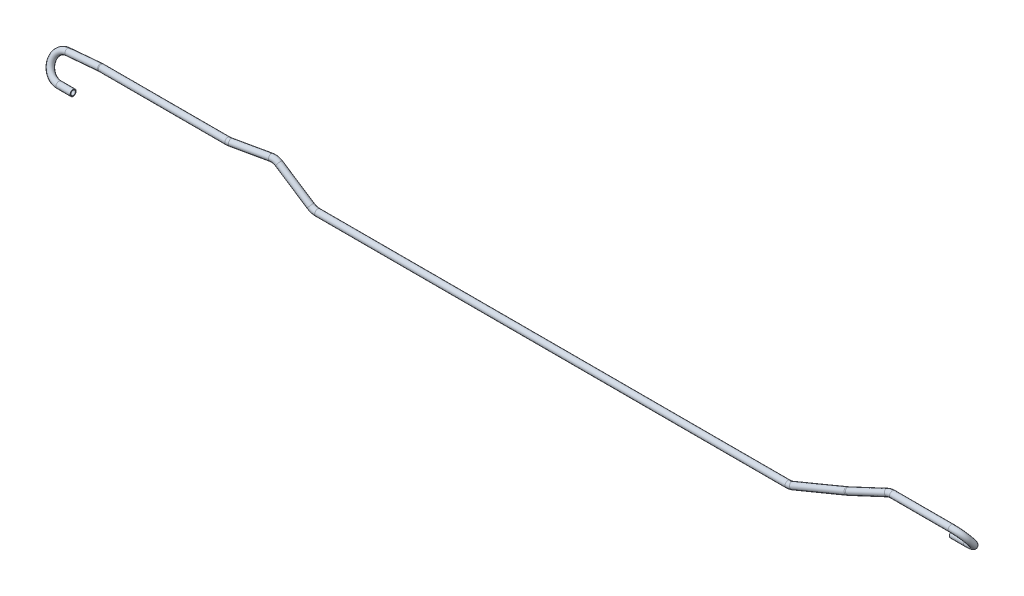
ISO-10303-21;
HEADER;
FILE_DESCRIPTION(('STEP AP214'),'2;1');
FILE_NAME('part.step','',(''),(''),'','','');
FILE_SCHEMA(('AUTOMOTIVE_DESIGN { 1 0 10303 214 1 1 1 1 }'));
ENDSEC;
DATA;
#1=APPLICATION_CONTEXT('core data for automotive mechanical design processes');
#2=APPLICATION_PROTOCOL_DEFINITION('international standard','automotive_design',2000,#1);
#3=PRODUCT_CONTEXT('',#1,'mechanical');
#4=PRODUCT('Part','Part','',(#3));
#5=PRODUCT_RELATED_PRODUCT_CATEGORY('part','',(#4));
#6=PRODUCT_DEFINITION_FORMATION('','',#4);
#7=PRODUCT_DEFINITION_CONTEXT('part definition',#1,'design');
#8=PRODUCT_DEFINITION('design','',#6,#7);
#9=PRODUCT_DEFINITION_SHAPE('','',#8);
#10=(LENGTH_UNIT() NAMED_UNIT(*) SI_UNIT(.MILLI.,.METRE.));
#11=(NAMED_UNIT(*) PLANE_ANGLE_UNIT() SI_UNIT($,.RADIAN.));
#12=(NAMED_UNIT(*) SI_UNIT($,.STERADIAN.) SOLID_ANGLE_UNIT());
#13=UNCERTAINTY_MEASURE_WITH_UNIT(LENGTH_MEASURE(1.E-05),#10,'distance_accuracy_value','');
#14=(GEOMETRIC_REPRESENTATION_CONTEXT(3) GLOBAL_UNCERTAINTY_ASSIGNED_CONTEXT((#13)) GLOBAL_UNIT_ASSIGNED_CONTEXT((#10,
#11,#12)) REPRESENTATION_CONTEXT('',''));
#15=CARTESIAN_POINT('',(0.,0.,0.));
#16=DIRECTION('',(0.,0.,1.));
#17=DIRECTION('',(1.,0.,0.));
#18=AXIS2_PLACEMENT_3D('',#15,#16,#17);
#19=CARTESIAN_POINT('',(-2235.,-51.0023810063754,98.9999999999986));
#20=DIRECTION('',(1.,0.,0.));
#21=DIRECTION('',(0.,0.,-1.));
#22=AXIS2_PLACEMENT_3D('',#19,#20,#21);
#23=CYLINDRICAL_SURFACE('',#22,8.);
#24=CARTESIAN_POINT('',(-2235.,-51.0023810063754,98.9999999999986));
#25=DIRECTION('',(1.,0.,0.));
#26=DIRECTION('',(0.,-0.823572064738296,0.567211648489961));
#27=AXIS2_PLACEMENT_3D('',#24,#25,#26);
#28=CIRCLE('',#27,8.);
#29=CARTESIAN_POINT('',(-2235.,-58.3869963909908,102.076923076922));
#30=VERTEX_POINT('',#29);
#31=EDGE_CURVE('E53',#30,#30,#28,.T.);
#32=ORIENTED_EDGE('',*,*,#31,.T.);
#33=EDGE_LOOP('',(#32));
#34=FACE_BOUND('',#33,.T.);
#35=CARTESIAN_POINT('',(-2198.,-51.0023810063754,98.9999999999986));
#36=DIRECTION('',(1.,0.,0.));
#37=DIRECTION('',(0.,-0.823572064738296,0.567211648489961));
#38=AXIS2_PLACEMENT_3D('',#35,#36,#37);
#39=CIRCLE('',#38,8.);
#40=CARTESIAN_POINT('',(-2198.,-57.5909575242817,103.537693187918));
#41=VERTEX_POINT('',#40);
#42=EDGE_CURVE('E10',#41,#41,#39,.T.);
#43=ORIENTED_EDGE('',*,*,#42,.F.);
#44=EDGE_LOOP('',(#43));
#45=FACE_BOUND('',#44,.T.);
#46=ADVANCED_FACE('F43',(#34,#45),#23,.T.);
#47=CARTESIAN_POINT('',(-2235.,-51.0023810063754,98.9999999999986));
#48=DIRECTION('',(1.,0.,0.));
#49=DIRECTION('',(0.,0.,-1.));
#50=AXIS2_PLACEMENT_3D('',#47,#48,#49);
#51=CYLINDRICAL_SURFACE('',#50,6.);
#52=CARTESIAN_POINT('',(-2235.,-51.0023810063754,98.9999999999986));
#53=DIRECTION('',(1.,0.,0.));
#54=DIRECTION('',(0.,-0.823572064738296,0.567211648489961));
#55=AXIS2_PLACEMENT_3D('',#52,#53,#54);
#56=CIRCLE('',#55,6.);
#57=CARTESIAN_POINT('',(-2235.,-56.5408425448369,101.307692307691));
#58=VERTEX_POINT('',#57);
#59=EDGE_CURVE('E57',#58,#58,#56,.T.);
#60=ORIENTED_EDGE('',*,*,#59,.F.);
#61=EDGE_LOOP('',(#60));
#62=FACE_BOUND('',#61,.T.);
#63=CARTESIAN_POINT('',(-2198.,-51.0023810063754,98.9999999999986));
#64=DIRECTION('',(1.,0.,0.));
#65=DIRECTION('',(0.,-0.823572064738296,0.567211648489961));
#66=AXIS2_PLACEMENT_3D('',#63,#64,#65);
#67=CIRCLE('',#66,6.);
#68=CARTESIAN_POINT('',(-2198.,-55.9438133948051,102.403269890938));
#69=VERTEX_POINT('',#68);
#70=EDGE_CURVE('E49',#69,#69,#67,.T.);
#71=ORIENTED_EDGE('',*,*,#70,.T.);
#72=EDGE_LOOP('',(#71));
#73=FACE_BOUND('',#72,.T.);
#74=ADVANCED_FACE('F293',(#62,#73),#51,.F.);
#75=CARTESIAN_POINT('',(-2235.,-20.5408425448359,86.3076923076905));
#76=DIRECTION('',(0.,0.384615384615384,0.923076923076923));
#77=DIRECTION('',(0.,-0.923076923076923,0.384615384615384));
#78=AXIS2_PLACEMENT_3D('',#75,#76,#77);
#79=TOROIDAL_SURFACE('',#78,33.0000000000011,8.);
#80=CARTESIAN_POINT('',(-2237.17958290928,9.85418159648477,73.6430989154736));
#81=DIRECTION('',(-0.997816449083727,-0.0609673541056993,0.0254030642106947));
#82=DIRECTION('',(-0.0646199236301112,0.980693517931945,-0.184565677622639));
#83=AXIS2_PLACEMENT_3D('',#80,#81,#82);
#84=CIRCLE('',#83,8.);
#85=CARTESIAN_POINT('',(-2237.70796664486,17.2226722974107,70.5728944567545));
#86=VERTEX_POINT('',#85);
#87=EDGE_CURVE('E62',#86,#86,#84,.T.);
#88=CARTESIAN_POINT('',(-2235.,-20.5408425448359,86.3076923076905));
#89=DIRECTION('',(0.,0.384615384615384,0.923076923076923));
#90=DIRECTION('',(0.,-0.923076923076923,0.384615384615384));
#91=AXIS2_PLACEMENT_3D('',#88,#89,#90);
#92=CIRCLE('',#91,41.0000000000011);
#93=EDGE_CURVE('',#86,#30,#92,.T.);
#94=ORIENTED_EDGE('',*,*,#87,.T.);
#95=ORIENTED_EDGE('',*,*,#31,.F.);
#96=ORIENTED_EDGE('',*,*,#93,.T.);
#97=ORIENTED_EDGE('',*,*,#93,.F.);
#98=EDGE_LOOP('',(#94,#96,#95,#97));
#99=FACE_BOUND('',#98,.T.);
#100=ADVANCED_FACE('F289',(#99),#79,.T.);
#101=CARTESIAN_POINT('',(-2235.,-20.5408425448359,86.3076923076905));
#102=DIRECTION('',(0.,0.384615384615384,0.923076923076923));
#103=DIRECTION('',(0.,-0.923076923076923,0.384615384615384));
#104=AXIS2_PLACEMENT_3D('',#101,#102,#103);
#105=TOROIDAL_SURFACE('',#104,33.0000000000011,6.);
#106=CARTESIAN_POINT('',(-2237.17958290928,9.85418159648477,73.6430989154736));
#107=DIRECTION('',(-0.997816449083727,-0.0609673541056993,0.0254030642106947));
#108=DIRECTION('',(-0.0646199236301112,0.980693517931945,-0.184565677622639));
#109=AXIS2_PLACEMENT_3D('',#106,#107,#108);
#110=CIRCLE('',#109,6.);
#111=CARTESIAN_POINT('',(-2237.57587071097,15.3805496221792,71.3404455714342));
#112=VERTEX_POINT('',#111);
#113=EDGE_CURVE('E65',#112,#112,#110,.T.);
#114=CARTESIAN_POINT('',(-2235.,-20.5408425448359,86.3076923076905));
#115=DIRECTION('',(0.,0.384615384615384,0.923076923076923));
#116=DIRECTION('',(0.,-0.923076923076923,0.384615384615384));
#117=AXIS2_PLACEMENT_3D('',#114,#115,#116);
#118=CIRCLE('',#117,39.0000000000011);
#119=EDGE_CURVE('',#112,#58,#118,.T.);
#120=ORIENTED_EDGE('',*,*,#113,.F.);
#121=ORIENTED_EDGE('',*,*,#59,.T.);
#122=ORIENTED_EDGE('',*,*,#119,.T.);
#123=ORIENTED_EDGE('',*,*,#119,.F.);
#124=EDGE_LOOP('',(#120,#122,#121,#123));
#125=FACE_BOUND('',#124,.T.);
#126=ADVANCED_FACE('F286',(#125),#105,.F.);
#127=CARTESIAN_POINT('',(-2154.08860034665,14.9311046734079,71.5277143000889));
#128=DIRECTION('',(-0.997816449083726,-0.060967354105705,0.0254030642107109));
#129=DIRECTION('',(0.0609870352261399,-0.998138558284533,0.));
#130=AXIS2_PLACEMENT_3D('',#127,#128,#129);
#131=CYLINDRICAL_SURFACE('',#130,8.);
#132=CARTESIAN_POINT('',(-2154.08860034665,14.9311046734079,71.5277143000889));
#133=DIRECTION('',(-0.997816449083727,-0.0609673541056993,0.0254030642106947));
#134=DIRECTION('',(-0.0646199236301112,0.980693517931945,-0.184565677622639));
#135=AXIS2_PLACEMENT_3D('',#132,#133,#134);
#136=CIRCLE('',#135,8.);
#137=CARTESIAN_POINT('',(-2154.61698408223,22.2995953743339,68.4575098413698));
#138=VERTEX_POINT('',#137);
#139=EDGE_CURVE('E68',#138,#138,#136,.T.);
#140=ORIENTED_EDGE('',*,*,#139,.T.);
#141=EDGE_LOOP('',(#140));
#142=FACE_BOUND('',#141,.T.);
#143=ORIENTED_EDGE('',*,*,#87,.F.);
#144=EDGE_LOOP('',(#143));
#145=FACE_BOUND('',#144,.T.);
#146=ADVANCED_FACE('F282',(#142,#145),#131,.T.);
#147=CARTESIAN_POINT('',(-2154.08860034665,14.9311046734079,71.5277143000889));
#148=DIRECTION('',(-0.997816449083726,-0.060967354105705,0.0254030642107109));
#149=DIRECTION('',(0.0609870352261399,-0.998138558284533,0.));
#150=AXIS2_PLACEMENT_3D('',#147,#148,#149);
#151=CYLINDRICAL_SURFACE('',#150,6.);
#152=CARTESIAN_POINT('',(-2154.08860034665,14.9311046734079,71.5277143000889));
#153=DIRECTION('',(-0.997816449083727,-0.0609673541056993,0.0254030642106947));
#154=DIRECTION('',(-0.0646199236301112,0.980693517931945,-0.184565677622639));
#155=AXIS2_PLACEMENT_3D('',#152,#153,#154);
#156=CIRCLE('',#155,6.);
#157=CARTESIAN_POINT('',(-2154.48488814834,20.4574726991024,69.2250609560495));
#158=VERTEX_POINT('',#157);
#159=EDGE_CURVE('E71',#158,#158,#156,.T.);
#160=ORIENTED_EDGE('',*,*,#159,.F.);
#161=EDGE_LOOP('',(#160));
#162=FACE_BOUND('',#161,.T.);
#163=ORIENTED_EDGE('',*,*,#113,.T.);
#164=EDGE_LOOP('',(#163));
#165=FACE_BOUND('',#164,.T.);
#166=ADVANCED_FACE('F279',(#162,#165),#151,.F.);
#167=CARTESIAN_POINT('',(-2151.90901743737,-15.4639194679128,84.1923076923059));
#168=DIRECTION('',(0.,0.384615384615385,0.923076923076923));
#169=DIRECTION('',(0.,-0.923076923076923,0.384615384615385));
#170=AXIS2_PLACEMENT_3D('',#167,#168,#169);
#171=TOROIDAL_SURFACE('',#170,33.0000000000011,8.);
#172=CARTESIAN_POINT('',(-2151.90901743737,14.9976189936267,71.4999999999978));
#173=DIRECTION('',(-1.,0.,0.));
#174=DIRECTION('',(0.,0.982665523802678,-0.185387346735444));
#175=AXIS2_PLACEMENT_3D('',#172,#173,#174);
#176=CIRCLE('',#175,8.);
#177=CARTESIAN_POINT('',(-2151.90901743737,22.3822343782421,68.4230769230747));
#178=VERTEX_POINT('',#177);
#179=EDGE_CURVE('E74',#178,#178,#176,.T.);
#180=CARTESIAN_POINT('',(-2151.90901743737,-15.4639194679128,84.1923076923059));
#181=DIRECTION('',(0.,0.384615384615385,0.923076923076923));
#182=DIRECTION('',(0.,-0.923076923076923,0.384615384615385));
#183=AXIS2_PLACEMENT_3D('',#180,#181,#182);
#184=CIRCLE('',#183,41.0000000000011);
#185=EDGE_CURVE('',#178,#138,#184,.T.);
#186=ORIENTED_EDGE('',*,*,#179,.T.);
#187=ORIENTED_EDGE('',*,*,#139,.F.);
#188=ORIENTED_EDGE('',*,*,#185,.T.);
#189=ORIENTED_EDGE('',*,*,#185,.F.);
#190=EDGE_LOOP('',(#186,#188,#187,#189));
#191=FACE_BOUND('',#190,.T.);
#192=ADVANCED_FACE('F275',(#191),#171,.T.);
#193=CARTESIAN_POINT('',(-2151.90901743737,-15.4639194679128,84.1923076923059));
#194=DIRECTION('',(0.,0.384615384615385,0.923076923076923));
#195=DIRECTION('',(0.,-0.923076923076923,0.384615384615385));
#196=AXIS2_PLACEMENT_3D('',#193,#194,#195);
#197=TOROIDAL_SURFACE('',#196,33.0000000000011,6.);
#198=CARTESIAN_POINT('',(-2151.90901743737,14.9976189936267,71.4999999999978));
#199=DIRECTION('',(-1.,0.,0.));
#200=DIRECTION('',(0.,0.982665523802678,-0.185387346735444));
#201=AXIS2_PLACEMENT_3D('',#198,#199,#200);
#202=CIRCLE('',#201,6.);
#203=CARTESIAN_POINT('',(-2151.90901743737,20.5360805320882,69.1923076923054));
#204=VERTEX_POINT('',#203);
#205=EDGE_CURVE('E77',#204,#204,#202,.T.);
#206=CARTESIAN_POINT('',(-2151.90901743737,-15.4639194679128,84.1923076923059));
#207=DIRECTION('',(0.,0.384615384615385,0.923076923076923));
#208=DIRECTION('',(0.,-0.923076923076923,0.384615384615385));
#209=AXIS2_PLACEMENT_3D('',#206,#207,#208);
#210=CIRCLE('',#209,39.0000000000011);
#211=EDGE_CURVE('',#204,#158,#210,.T.);
#212=ORIENTED_EDGE('',*,*,#205,.F.);
#213=ORIENTED_EDGE('',*,*,#159,.T.);
#214=ORIENTED_EDGE('',*,*,#211,.T.);
#215=ORIENTED_EDGE('',*,*,#211,.F.);
#216=EDGE_LOOP('',(#212,#214,#213,#215));
#217=FACE_BOUND('',#216,.T.);
#218=ADVANCED_FACE('F272',(#217),#197,.F.);
#219=CARTESIAN_POINT('',(-1821.5074252003,14.9976189936267,71.4999999999978));
#220=DIRECTION('',(-1.,0.,0.));
#221=DIRECTION('',(0.,0.,1.));
#222=AXIS2_PLACEMENT_3D('',#219,#220,#221);
#223=CYLINDRICAL_SURFACE('',#222,8.);
#224=CARTESIAN_POINT('',(-1821.5074252003,14.9976189936267,71.4999999999978));
#225=DIRECTION('',(-1.,0.,0.));
#226=DIRECTION('',(0.,0.982665523802678,-0.185387346735444));
#227=AXIS2_PLACEMENT_3D('',#224,#225,#226);
#228=CIRCLE('',#227,8.);
#229=CARTESIAN_POINT('',(-1821.5074252003,14.9976189936267,79.4999999999978));
#230=VERTEX_POINT('',#229);
#231=EDGE_CURVE('E80',#230,#230,#228,.T.);
#232=ORIENTED_EDGE('',*,*,#231,.T.);
#233=EDGE_LOOP('',(#232));
#234=FACE_BOUND('',#233,.T.);
#235=ORIENTED_EDGE('',*,*,#179,.F.);
#236=EDGE_LOOP('',(#235));
#237=FACE_BOUND('',#236,.T.);
#238=ADVANCED_FACE('F268',(#234,#237),#223,.T.);
#239=CARTESIAN_POINT('',(-1821.5074252003,14.9976189936267,71.4999999999978));
#240=DIRECTION('',(-1.,0.,0.));
#241=DIRECTION('',(0.,0.,1.));
#242=AXIS2_PLACEMENT_3D('',#239,#240,#241);
#243=CYLINDRICAL_SURFACE('',#242,6.);
#244=CARTESIAN_POINT('',(-1821.5074252003,14.9976189936267,71.4999999999978));
#245=DIRECTION('',(-1.,0.,0.));
#246=DIRECTION('',(0.,0.982665523802678,-0.185387346735444));
#247=AXIS2_PLACEMENT_3D('',#244,#245,#246);
#248=CIRCLE('',#247,6.);
#249=CARTESIAN_POINT('',(-1821.5074252003,14.9976189936267,77.4999999999978));
#250=VERTEX_POINT('',#249);
#251=EDGE_CURVE('E83',#250,#250,#248,.T.);
#252=ORIENTED_EDGE('',*,*,#251,.F.);
#253=EDGE_LOOP('',(#252));
#254=FACE_BOUND('',#253,.T.);
#255=ORIENTED_EDGE('',*,*,#205,.T.);
#256=EDGE_LOOP('',(#255));
#257=FACE_BOUND('',#256,.T.);
#258=ADVANCED_FACE('F265',(#254,#257),#243,.F.);
#259=CARTESIAN_POINT('',(-1821.5074252003,14.9976189936267,38.5000000000004));
#260=DIRECTION('',(0.,-1.,0.));
#261=DIRECTION('',(0.,0.,-1.));
#262=AXIS2_PLACEMENT_3D('',#259,#260,#261);
#263=TOROIDAL_SURFACE('',#262,32.9999999999974,8.);
#264=CARTESIAN_POINT('',(-1814.57093378604,14.9976189936267,70.7627507639966));
#265=DIRECTION('',(-0.977659114060571,0.,0.210196709523008));
#266=DIRECTION('',(-0.0389678102709847,0.982665523802678,-0.181245629167416));
#267=AXIS2_PLACEMENT_3D('',#264,#265,#266);
#268=CIRCLE('',#267,8.);
#269=CARTESIAN_POINT('',(-1812.88936010986,14.9976189936267,78.5840236764811));
#270=VERTEX_POINT('',#269);
#271=EDGE_CURVE('E86',#270,#270,#268,.T.);
#272=CARTESIAN_POINT('',(-1821.5074252003,14.9976189936267,38.5000000000004));
#273=DIRECTION('',(0.,-1.,0.));
#274=DIRECTION('',(0.,0.,-1.));
#275=AXIS2_PLACEMENT_3D('',#272,#273,#274);
#276=CIRCLE('',#275,40.9999999999974);
#277=EDGE_CURVE('',#270,#230,#276,.T.);
#278=ORIENTED_EDGE('',*,*,#271,.T.);
#279=ORIENTED_EDGE('',*,*,#231,.F.);
#280=ORIENTED_EDGE('',*,*,#277,.T.);
#281=ORIENTED_EDGE('',*,*,#277,.F.);
#282=EDGE_LOOP('',(#278,#280,#279,#281));
#283=FACE_BOUND('',#282,.T.);
#284=ADVANCED_FACE('F261',(#283),#263,.T.);
#285=CARTESIAN_POINT('',(-1821.5074252003,14.9976189936267,38.5000000000004));
#286=DIRECTION('',(0.,-1.,0.));
#287=DIRECTION('',(0.,0.,-1.));
#288=AXIS2_PLACEMENT_3D('',#285,#286,#287);
#289=TOROIDAL_SURFACE('',#288,32.9999999999974,6.);
#290=CARTESIAN_POINT('',(-1814.57093378604,14.9976189936267,70.7627507639966));
#291=DIRECTION('',(-0.977659114060571,0.,0.210196709523008));
#292=DIRECTION('',(-0.0389678102709847,0.982665523802678,-0.181245629167416));
#293=AXIS2_PLACEMENT_3D('',#290,#291,#292);
#294=CIRCLE('',#293,6.);
#295=CARTESIAN_POINT('',(-1813.3097535289,14.9976189936267,76.6287054483599));
#296=VERTEX_POINT('',#295);
#297=EDGE_CURVE('E89',#296,#296,#294,.T.);
#298=CARTESIAN_POINT('',(-1821.5074252003,14.9976189936267,38.5000000000004));
#299=DIRECTION('',(0.,-1.,0.));
#300=DIRECTION('',(0.,0.,-1.));
#301=AXIS2_PLACEMENT_3D('',#298,#299,#300);
#302=CIRCLE('',#301,38.9999999999974);
#303=EDGE_CURVE('',#296,#250,#302,.T.);
#304=ORIENTED_EDGE('',*,*,#297,.F.);
#305=ORIENTED_EDGE('',*,*,#251,.T.);
#306=ORIENTED_EDGE('',*,*,#303,.T.);
#307=ORIENTED_EDGE('',*,*,#303,.F.);
#308=EDGE_LOOP('',(#304,#306,#305,#307));
#309=FACE_BOUND('',#308,.T.);
#310=ADVANCED_FACE('F258',(#309),#289,.F.);
#311=CARTESIAN_POINT('',(-1728.27069487577,14.9976189936267,52.2081993982879));
#312=DIRECTION('',(-0.977659114060568,0.,0.210196709523022));
#313=DIRECTION('',(0.210196709523022,0.,0.977659114060568));
#314=AXIS2_PLACEMENT_3D('',#311,#312,#313);
#315=CYLINDRICAL_SURFACE('',#314,8.);
#316=CARTESIAN_POINT('',(-1728.27069487577,14.9976189936267,52.2081993982879));
#317=DIRECTION('',(-0.977659114060571,0.,0.210196709523008));
#318=DIRECTION('',(-0.0389678102709847,0.982665523802678,-0.181245629167416));
#319=AXIS2_PLACEMENT_3D('',#316,#317,#318);
#320=CIRCLE('',#319,8.);
#321=CARTESIAN_POINT('',(-1728.78098779352,22.6203685273136,49.8347439669026));
#322=VERTEX_POINT('',#321);
#323=EDGE_CURVE('E92',#322,#322,#320,.T.);
#324=ORIENTED_EDGE('',*,*,#323,.T.);
#325=EDGE_LOOP('',(#324));
#326=FACE_BOUND('',#325,.T.);
#327=ORIENTED_EDGE('',*,*,#271,.F.);
#328=EDGE_LOOP('',(#327));
#329=FACE_BOUND('',#328,.T.);
#330=ADVANCED_FACE('F254',(#326,#329),#315,.T.);
#331=CARTESIAN_POINT('',(-1728.27069487577,14.9976189936267,52.2081993982879));
#332=DIRECTION('',(-0.977659114060568,0.,0.210196709523022));
#333=DIRECTION('',(0.210196709523022,0.,0.977659114060568));
#334=AXIS2_PLACEMENT_3D('',#331,#332,#333);
#335=CYLINDRICAL_SURFACE('',#334,6.);
#336=CARTESIAN_POINT('',(-1728.27069487577,14.9976189936267,52.2081993982879));
#337=DIRECTION('',(-0.977659114060571,0.,0.210196709523008));
#338=DIRECTION('',(-0.0389678102709847,0.982665523802678,-0.181245629167416));
#339=AXIS2_PLACEMENT_3D('',#336,#337,#338);
#340=CIRCLE('',#339,6.);
#341=CARTESIAN_POINT('',(-1728.65341456408,20.7146811438919,50.4281078247489));
#342=VERTEX_POINT('',#341);
#343=EDGE_CURVE('E95',#342,#342,#340,.T.);
#344=ORIENTED_EDGE('',*,*,#343,.F.);
#345=EDGE_LOOP('',(#344));
#346=FACE_BOUND('',#345,.T.);
#347=ORIENTED_EDGE('',*,*,#297,.T.);
#348=EDGE_LOOP('',(#347));
#349=FACE_BOUND('',#348,.T.);
#350=ADVANCED_FACE('F251',(#346,#349),#335,.F.);
#351=CARTESIAN_POINT('',(-1726.16573659006,-16.4462228328327,61.9987030527522));
#352=DIRECTION('',(0.20028460868739,0.30346152831423,0.931556319476247));
#353=DIRECTION('',(0.,-0.950822106578474,0.309737504415713));
#354=AXIS2_PLACEMENT_3D('',#351,#352,#353);
#355=TOROIDAL_SURFACE('',#354,33.0000000000009,8.);
#356=CARTESIAN_POINT('',(-1709.2320987633,9.21080417740537,49.9999999999976));
#357=DIRECTION('',(-0.834609406561721,0.550842208330745,0.));
#358=DIRECTION('',(0.533681183443436,0.808607853702155,-0.247664558162056));
#359=AXIS2_PLACEMENT_3D('',#356,#357,#358);
#360=CIRCLE('',#359,8.);
#361=CARTESIAN_POINT('',(-1705.12697444166,15.4306895132206,47.0912235023602));
#362=VERTEX_POINT('',#361);
#363=EDGE_CURVE('E98',#362,#362,#360,.T.);
#364=CARTESIAN_POINT('',(-1726.16573659006,-16.4462228328327,61.9987030527522));
#365=DIRECTION('',(0.20028460868739,0.30346152831423,0.931556319476247));
#366=DIRECTION('',(0.,-0.950822106578474,0.309737504415713));
#367=AXIS2_PLACEMENT_3D('',#364,#365,#366);
#368=CIRCLE('',#367,41.0000000000009);
#369=EDGE_CURVE('',#362,#322,#368,.T.);
#370=ORIENTED_EDGE('',*,*,#363,.T.);
#371=ORIENTED_EDGE('',*,*,#323,.F.);
#372=ORIENTED_EDGE('',*,*,#369,.T.);
#373=ORIENTED_EDGE('',*,*,#369,.F.);
#374=EDGE_LOOP('',(#370,#372,#371,#373));
#375=FACE_BOUND('',#374,.T.);
#376=ADVANCED_FACE('F247',(#375),#355,.T.);
#377=CARTESIAN_POINT('',(-1726.16573659006,-16.4462228328327,61.9987030527522));
#378=DIRECTION('',(0.20028460868739,0.30346152831423,0.931556319476247));
#379=DIRECTION('',(0.,-0.950822106578474,0.309737504415713));
#380=AXIS2_PLACEMENT_3D('',#377,#378,#379);
#381=TOROIDAL_SURFACE('',#380,33.0000000000009,6.);
#382=CARTESIAN_POINT('',(-1709.2320987633,9.21080417740537,49.9999999999976));
#383=DIRECTION('',(-0.834609406561721,0.550842208330745,0.));
#384=DIRECTION('',(0.533681183443436,0.808607853702155,-0.247664558162056));
#385=AXIS2_PLACEMENT_3D('',#382,#383,#384);
#386=CIRCLE('',#385,6.);
#387=CARTESIAN_POINT('',(-1706.15325552207,13.8757181792668,47.8184176267696));
#388=VERTEX_POINT('',#387);
#389=EDGE_CURVE('E101',#388,#388,#386,.T.);
#390=CARTESIAN_POINT('',(-1726.16573659006,-16.4462228328327,61.9987030527522));
#391=DIRECTION('',(0.20028460868739,0.30346152831423,0.931556319476247));
#392=DIRECTION('',(0.,-0.950822106578474,0.309737504415713));
#393=AXIS2_PLACEMENT_3D('',#390,#391,#392);
#394=CIRCLE('',#393,39.0000000000009);
#395=EDGE_CURVE('',#388,#342,#394,.T.);
#396=ORIENTED_EDGE('',*,*,#389,.F.);
#397=ORIENTED_EDGE('',*,*,#343,.T.);
#398=ORIENTED_EDGE('',*,*,#395,.T.);
#399=ORIENTED_EDGE('',*,*,#395,.F.);
#400=EDGE_LOOP('',(#396,#398,#397,#399));
#401=FACE_BOUND('',#400,.T.);
#402=ADVANCED_FACE('F244',(#401),#381,.F.);
#403=CARTESIAN_POINT('',(-1626.26952967191,-45.5444914229104,49.9999999999975));
#404=DIRECTION('',(-0.834609406561725,0.550842208330739,0.));
#405=DIRECTION('',(-0.55084220833074,-0.834609406561725,0.));
#406=AXIS2_PLACEMENT_3D('',#403,#404,#405);
#407=CYLINDRICAL_SURFACE('',#406,8.);
#408=CARTESIAN_POINT('',(-1626.26952967191,-45.5444914229104,49.9999999999975));
#409=DIRECTION('',(-0.834609406561721,0.550842208330745,0.));
#410=DIRECTION('',(0.533681183443436,0.808607853702155,-0.247664558162056));
#411=AXIS2_PLACEMENT_3D('',#408,#409,#410);
#412=CIRCLE('',#411,8.);
#413=CARTESIAN_POINT('',(-1630.67626733856,-52.2213666754043,49.9999999999975));
#414=VERTEX_POINT('',#413);
#415=EDGE_CURVE('E104',#414,#414,#412,.T.);
#416=ORIENTED_EDGE('',*,*,#415,.T.);
#417=EDGE_LOOP('',(#416));
#418=FACE_BOUND('',#417,.T.);
#419=ORIENTED_EDGE('',*,*,#363,.F.);
#420=EDGE_LOOP('',(#419));
#421=FACE_BOUND('',#420,.T.);
#422=ADVANCED_FACE('F240',(#418,#421),#407,.T.);
#423=CARTESIAN_POINT('',(-1626.26952967191,-45.5444914229104,49.9999999999975));
#424=DIRECTION('',(-0.834609406561725,0.550842208330739,0.));
#425=DIRECTION('',(-0.55084220833074,-0.834609406561725,0.));
#426=AXIS2_PLACEMENT_3D('',#423,#424,#425);
#427=CYLINDRICAL_SURFACE('',#426,6.);
#428=CARTESIAN_POINT('',(-1626.26952967191,-45.5444914229104,49.9999999999975));
#429=DIRECTION('',(-0.834609406561721,0.550842208330745,0.));
#430=DIRECTION('',(0.533681183443436,0.808607853702155,-0.247664558162056));
#431=AXIS2_PLACEMENT_3D('',#428,#429,#430);
#432=CIRCLE('',#431,6.);
#433=CARTESIAN_POINT('',(-1629.5745829219,-50.5521478622808,49.9999999999975));
#434=VERTEX_POINT('',#433);
#435=EDGE_CURVE('E107',#434,#434,#432,.T.);
#436=ORIENTED_EDGE('',*,*,#435,.F.);
#437=EDGE_LOOP('',(#436));
#438=FACE_BOUND('',#437,.T.);
#439=ORIENTED_EDGE('',*,*,#389,.T.);
#440=EDGE_LOOP('',(#439));
#441=FACE_BOUND('',#440,.T.);
#442=ADVANCED_FACE('F237',(#438,#441),#427,.F.);
#443=CARTESIAN_POINT('',(-1608.091736797,-18.0023810063734,49.9999999999975));
#444=DIRECTION('',(0.,0.,-1.));
#445=DIRECTION('',(-1.,0.,0.));
#446=AXIS2_PLACEMENT_3D('',#443,#444,#445);
#447=TOROIDAL_SURFACE('',#446,33.0000000000003,8.);
#448=CARTESIAN_POINT('',(-1608.091736797,-51.0023810063737,49.9999999999975));
#449=DIRECTION('',(-1.,0.,0.));
#450=DIRECTION('',(0.,0.96884584255205,-0.247664558162056));
#451=AXIS2_PLACEMENT_3D('',#448,#449,#450);
#452=CIRCLE('',#451,8.);
#453=CARTESIAN_POINT('',(-1608.091736797,-59.0023810063737,49.9999999999975));
#454=VERTEX_POINT('',#453);
#455=EDGE_CURVE('E110',#454,#454,#452,.T.);
#456=CARTESIAN_POINT('',(-1608.091736797,-18.0023810063734,49.9999999999975));
#457=DIRECTION('',(0.,0.,-1.));
#458=DIRECTION('',(-1.,0.,0.));
#459=AXIS2_PLACEMENT_3D('',#456,#457,#458);
#460=CIRCLE('',#459,41.0000000000003);
#461=EDGE_CURVE('',#454,#414,#460,.T.);
#462=ORIENTED_EDGE('',*,*,#455,.T.);
#463=ORIENTED_EDGE('',*,*,#415,.F.);
#464=ORIENTED_EDGE('',*,*,#461,.T.);
#465=ORIENTED_EDGE('',*,*,#461,.F.);
#466=EDGE_LOOP('',(#462,#464,#463,#465));
#467=FACE_BOUND('',#466,.T.);
#468=ADVANCED_FACE('F233',(#467),#447,.T.);
#469=CARTESIAN_POINT('',(-1608.091736797,-18.0023810063734,49.9999999999975));
#470=DIRECTION('',(0.,0.,-1.));
#471=DIRECTION('',(-1.,0.,0.));
#472=AXIS2_PLACEMENT_3D('',#469,#470,#471);
#473=TOROIDAL_SURFACE('',#472,33.0000000000003,6.);
#474=CARTESIAN_POINT('',(-1608.091736797,-51.0023810063737,49.9999999999975));
#475=DIRECTION('',(-1.,0.,0.));
#476=DIRECTION('',(0.,0.96884584255205,-0.247664558162056));
#477=AXIS2_PLACEMENT_3D('',#474,#475,#476);
#478=CIRCLE('',#477,6.);
#479=CARTESIAN_POINT('',(-1608.091736797,-57.0023810063737,49.9999999999975));
#480=VERTEX_POINT('',#479);
#481=EDGE_CURVE('E113',#480,#480,#478,.T.);
#482=CARTESIAN_POINT('',(-1608.091736797,-18.0023810063734,49.9999999999975));
#483=DIRECTION('',(0.,0.,-1.));
#484=DIRECTION('',(-1.,0.,0.));
#485=AXIS2_PLACEMENT_3D('',#482,#483,#484);
#486=CIRCLE('',#485,39.0000000000003);
#487=EDGE_CURVE('',#480,#434,#486,.T.);
#488=ORIENTED_EDGE('',*,*,#481,.F.);
#489=ORIENTED_EDGE('',*,*,#435,.T.);
#490=ORIENTED_EDGE('',*,*,#487,.T.);
#491=ORIENTED_EDGE('',*,*,#487,.F.);
#492=EDGE_LOOP('',(#488,#490,#489,#491));
#493=FACE_BOUND('',#492,.T.);
#494=ADVANCED_FACE('F230',(#493),#473,.F.);
#495=CARTESIAN_POINT('',(-379.560981206118,-51.0023810063737,49.999999999999));
#496=DIRECTION('',(-1.,0.,0.));
#497=DIRECTION('',(0.,0.,1.));
#498=AXIS2_PLACEMENT_3D('',#495,#496,#497);
#499=CYLINDRICAL_SURFACE('',#498,8.);
#500=CARTESIAN_POINT('',(-379.560981206118,-51.0023810063737,49.999999999999));
#501=DIRECTION('',(-1.,0.,0.));
#502=DIRECTION('',(0.,0.96884584255205,-0.247664558162056));
#503=AXIS2_PLACEMENT_3D('',#500,#501,#502);
#504=CIRCLE('',#503,8.);
#505=CARTESIAN_POINT('',(-379.560981206118,-59.0023810063737,49.999999999999));
#506=VERTEX_POINT('',#505);
#507=EDGE_CURVE('E116',#506,#506,#504,.T.);
#508=ORIENTED_EDGE('',*,*,#507,.T.);
#509=EDGE_LOOP('',(#508));
#510=FACE_BOUND('',#509,.T.);
#511=ORIENTED_EDGE('',*,*,#455,.F.);
#512=EDGE_LOOP('',(#511));
#513=FACE_BOUND('',#512,.T.);
#514=ADVANCED_FACE('F226',(#510,#513),#499,.T.);
#515=CARTESIAN_POINT('',(-379.560981206118,-51.0023810063737,49.999999999999));
#516=DIRECTION('',(-1.,0.,0.));
#517=DIRECTION('',(0.,0.,1.));
#518=AXIS2_PLACEMENT_3D('',#515,#516,#517);
#519=CYLINDRICAL_SURFACE('',#518,6.);
#520=CARTESIAN_POINT('',(-379.560981206118,-51.0023810063737,49.999999999999));
#521=DIRECTION('',(-1.,0.,0.));
#522=DIRECTION('',(0.,0.96884584255205,-0.247664558162056));
#523=AXIS2_PLACEMENT_3D('',#520,#521,#522);
#524=CIRCLE('',#523,6.);
#525=CARTESIAN_POINT('',(-379.560981206118,-57.0023810063737,49.999999999999));
#526=VERTEX_POINT('',#525);
#527=EDGE_CURVE('E119',#526,#526,#524,.T.);
#528=ORIENTED_EDGE('',*,*,#527,.F.);
#529=EDGE_LOOP('',(#528));
#530=FACE_BOUND('',#529,.T.);
#531=ORIENTED_EDGE('',*,*,#481,.T.);
#532=EDGE_LOOP('',(#531));
#533=FACE_BOUND('',#532,.T.);
#534=ADVANCED_FACE('F223',(#530,#533),#519,.F.);
#535=CARTESIAN_POINT('',(-379.560981206118,-18.0023810063733,49.999999999999));
#536=DIRECTION('',(0.,0.,-1.));
#537=DIRECTION('',(0.,1.,0.));
#538=AXIS2_PLACEMENT_3D('',#535,#536,#537);
#539=TOROIDAL_SURFACE('',#538,33.0000000000003,8.);
#540=CARTESIAN_POINT('',(-366.937986134593,-48.4927072660951,49.999999999999));
#541=DIRECTION('',(-0.92394928059762,-0.382515002167418,0.));
#542=DIRECTION('',(-0.370598069563688,0.895164419235964,-0.247664558162056));
#543=AXIS2_PLACEMENT_3D('',#540,#541,#542);
#544=CIRCLE('',#543,8.);
#545=CARTESIAN_POINT('',(-363.877866117254,-55.8843015108761,49.999999999999));
#546=VERTEX_POINT('',#545);
#547=EDGE_CURVE('E122',#546,#546,#544,.T.);
#548=CARTESIAN_POINT('',(-379.560981206118,-18.0023810063733,49.999999999999));
#549=DIRECTION('',(0.,0.,-1.));
#550=DIRECTION('',(0.,1.,0.));
#551=AXIS2_PLACEMENT_3D('',#548,#549,#550);
#552=CIRCLE('',#551,41.0000000000003);
#553=EDGE_CURVE('',#546,#506,#552,.T.);
#554=ORIENTED_EDGE('',*,*,#547,.T.);
#555=ORIENTED_EDGE('',*,*,#507,.F.);
#556=ORIENTED_EDGE('',*,*,#553,.T.);
#557=ORIENTED_EDGE('',*,*,#553,.F.);
#558=EDGE_LOOP('',(#554,#556,#555,#557));
#559=FACE_BOUND('',#558,.T.);
#560=ADVANCED_FACE('F219',(#559),#539,.T.);
#561=CARTESIAN_POINT('',(-379.560981206118,-18.0023810063733,49.999999999999));
#562=DIRECTION('',(0.,0.,-1.));
#563=DIRECTION('',(0.,1.,0.));
#564=AXIS2_PLACEMENT_3D('',#561,#562,#563);
#565=TOROIDAL_SURFACE('',#564,33.0000000000003,6.);
#566=CARTESIAN_POINT('',(-366.937986134593,-48.4927072660951,49.999999999999));
#567=DIRECTION('',(-0.92394928059762,-0.382515002167418,0.));
#568=DIRECTION('',(-0.370598069563688,0.895164419235964,-0.247664558162056));
#569=AXIS2_PLACEMENT_3D('',#566,#567,#568);
#570=CIRCLE('',#569,6.);
#571=CARTESIAN_POINT('',(-364.642896121588,-54.0364029496809,49.999999999999));
#572=VERTEX_POINT('',#571);
#573=EDGE_CURVE('E125',#572,#572,#570,.T.);
#574=CARTESIAN_POINT('',(-379.560981206118,-18.0023810063733,49.999999999999));
#575=DIRECTION('',(0.,0.,-1.));
#576=DIRECTION('',(0.,1.,0.));
#577=AXIS2_PLACEMENT_3D('',#574,#575,#576);
#578=CIRCLE('',#577,39.0000000000003);
#579=EDGE_CURVE('',#572,#526,#578,.T.);
#580=ORIENTED_EDGE('',*,*,#573,.F.);
#581=ORIENTED_EDGE('',*,*,#527,.T.);
#582=ORIENTED_EDGE('',*,*,#579,.T.);
#583=ORIENTED_EDGE('',*,*,#579,.F.);
#584=EDGE_LOOP('',(#580,#582,#581,#583));
#585=FACE_BOUND('',#584,.T.);
#586=ADVANCED_FACE('F216',(#585),#565,.F.);
#587=CARTESIAN_POINT('',(-224.405582323855,10.5157079115502,49.999999999999));
#588=DIRECTION('',(-0.923949280597622,-0.382515002167415,0.));
#589=DIRECTION('',(0.382515002167415,-0.923949280597622,0.));
#590=AXIS2_PLACEMENT_3D('',#587,#588,#589);
#591=CYLINDRICAL_SURFACE('',#590,8.);
#592=CARTESIAN_POINT('',(-224.405582323855,10.5157079115502,49.999999999999));
#593=DIRECTION('',(-0.92394928059762,-0.382515002167418,0.));
#594=DIRECTION('',(-0.370598069563688,0.895164419235964,-0.247664558162056));
#595=AXIS2_PLACEMENT_3D('',#592,#593,#594);
#596=CIRCLE('',#595,8.);
#597=CARTESIAN_POINT('',(-224.405582323855,10.5157079115502,57.999999999999));
#598=VERTEX_POINT('',#597);
#599=EDGE_CURVE('E128',#598,#598,#596,.T.);
#600=ORIENTED_EDGE('',*,*,#599,.T.);
#601=EDGE_LOOP('',(#600));
#602=FACE_BOUND('',#601,.T.);
#603=ORIENTED_EDGE('',*,*,#547,.F.);
#604=EDGE_LOOP('',(#603));
#605=FACE_BOUND('',#604,.T.);
#606=ADVANCED_FACE('F212',(#602,#605),#591,.T.);
#607=CARTESIAN_POINT('',(-224.405582323855,10.5157079115502,49.999999999999));
#608=DIRECTION('',(-0.923949280597622,-0.382515002167415,0.));
#609=DIRECTION('',(0.382515002167415,-0.923949280597622,0.));
#610=AXIS2_PLACEMENT_3D('',#607,#608,#609);
#611=CYLINDRICAL_SURFACE('',#610,6.);
#612=CARTESIAN_POINT('',(-224.405582323855,10.5157079115502,49.999999999999));
#613=DIRECTION('',(-0.92394928059762,-0.382515002167418,0.));
#614=DIRECTION('',(-0.370598069563688,0.895164419235964,-0.247664558162056));
#615=AXIS2_PLACEMENT_3D('',#612,#613,#614);
#616=CIRCLE('',#615,6.);
#617=CARTESIAN_POINT('',(-224.405582323855,10.5157079115502,55.999999999999));
#618=VERTEX_POINT('',#617);
#619=EDGE_CURVE('E131',#618,#618,#616,.T.);
#620=ORIENTED_EDGE('',*,*,#619,.F.);
#621=EDGE_LOOP('',(#620));
#622=FACE_BOUND('',#621,.T.);
#623=ORIENTED_EDGE('',*,*,#573,.T.);
#624=EDGE_LOOP('',(#623));
#625=FACE_BOUND('',#624,.T.);
#626=ADVANCED_FACE('F209',(#622,#625),#611,.F.);
#627=CARTESIAN_POINT('',(-224.405582323855,10.5157079115502,17.0000000000002));
#628=DIRECTION('',(0.382515002167415,-0.923949280597622,0.));
#629=DIRECTION('',(0.923949280597622,0.382515002167415,0.));
#630=AXIS2_PLACEMENT_3D('',#627,#628,#629);
#631=TOROIDAL_SURFACE('',#630,32.9999999999988,8.);
#632=CARTESIAN_POINT('',(-221.600379137761,11.6770620305932,49.8600379137767));
#633=DIRECTION('',(-0.920030557298347,-0.380892650721519,0.0920030557298359));
#634=DIRECTION('',(-0.391651081916382,0.886448472121949,-0.246614144578914));
#635=AXIS2_PLACEMENT_3D('',#632,#633,#634);
#636=CIRCLE('',#635,8.);
#637=CARTESIAN_POINT('',(-220.920329880526,11.9586024230885,57.8261077110562));
#638=VERTEX_POINT('',#637);
#639=EDGE_CURVE('E134',#638,#638,#636,.T.);
#640=CARTESIAN_POINT('',(-224.405582323855,10.5157079115502,17.0000000000002));
#641=DIRECTION('',(0.382515002167415,-0.923949280597622,0.));
#642=DIRECTION('',(0.923949280597622,0.382515002167415,0.));
#643=AXIS2_PLACEMENT_3D('',#640,#641,#642);
#644=CIRCLE('',#643,40.9999999999988);
#645=EDGE_CURVE('',#638,#598,#644,.T.);
#646=ORIENTED_EDGE('',*,*,#639,.T.);
#647=ORIENTED_EDGE('',*,*,#599,.F.);
#648=ORIENTED_EDGE('',*,*,#645,.T.);
#649=ORIENTED_EDGE('',*,*,#645,.F.);
#650=EDGE_LOOP('',(#646,#648,#647,#649));
#651=FACE_BOUND('',#650,.T.);
#652=ADVANCED_FACE('F205',(#651),#631,.T.);
#653=CARTESIAN_POINT('',(-224.405582323855,10.5157079115502,17.0000000000002));
#654=DIRECTION('',(0.382515002167415,-0.923949280597622,0.));
#655=DIRECTION('',(0.923949280597622,0.382515002167415,0.));
#656=AXIS2_PLACEMENT_3D('',#653,#654,#655);
#657=TOROIDAL_SURFACE('',#656,32.9999999999988,6.);
#658=CARTESIAN_POINT('',(-221.600379137761,11.6770620305932,49.8600379137767));
#659=DIRECTION('',(-0.920030557298347,-0.380892650721519,0.0920030557298359));
#660=DIRECTION('',(-0.391651081916382,0.886448472121949,-0.246614144578914));
#661=AXIS2_PLACEMENT_3D('',#658,#659,#660);
#662=CIRCLE('',#661,6.);
#663=CARTESIAN_POINT('',(-221.090342194835,11.8882173249647,55.8345902617363));
#664=VERTEX_POINT('',#663);
#665=EDGE_CURVE('E137',#664,#664,#662,.T.);
#666=CARTESIAN_POINT('',(-224.405582323855,10.5157079115502,17.0000000000002));
#667=DIRECTION('',(0.382515002167415,-0.923949280597622,0.));
#668=DIRECTION('',(0.923949280597622,0.382515002167415,0.));
#669=AXIS2_PLACEMENT_3D('',#666,#667,#668);
#670=CIRCLE('',#669,38.9999999999988);
#671=EDGE_CURVE('',#664,#618,#670,.T.);
#672=ORIENTED_EDGE('',*,*,#665,.F.);
#673=ORIENTED_EDGE('',*,*,#619,.T.);
#674=ORIENTED_EDGE('',*,*,#671,.T.);
#675=ORIENTED_EDGE('',*,*,#671,.F.);
#676=EDGE_LOOP('',(#672,#674,#673,#675));
#677=FACE_BOUND('',#676,.T.);
#678=ADVANCED_FACE('F202',(#677),#657,.F.);
#679=CARTESIAN_POINT('',(-129.196181864792,49.9323997016026,40.6196181864794));
#680=DIRECTION('',(-0.920030557298347,-0.380892650721519,0.0920030557298396));
#681=DIRECTION('',(0.382515002167418,-0.92394928059762,0.));
#682=AXIS2_PLACEMENT_3D('',#679,#680,#681);
#683=CYLINDRICAL_SURFACE('',#682,8.);
#684=CARTESIAN_POINT('',(-129.196181864792,49.9323997016026,40.6196181864794));
#685=DIRECTION('',(-0.920030557298347,-0.380892650721519,0.0920030557298359));
#686=DIRECTION('',(-0.391651081916382,0.886448472121949,-0.246614144578914));
#687=AXIS2_PLACEMENT_3D('',#684,#685,#686);
#688=CIRCLE('',#687,8.);
#689=CARTESIAN_POINT('',(-132.330954825118,57.0868904598038,38.8914803221796));
#690=VERTEX_POINT('',#689);
#691=EDGE_CURVE('E140',#690,#690,#688,.T.);
#692=ORIENTED_EDGE('',*,*,#691,.T.);
#693=EDGE_LOOP('',(#692));
#694=FACE_BOUND('',#693,.T.);
#695=ORIENTED_EDGE('',*,*,#639,.F.);
#696=EDGE_LOOP('',(#695));
#697=FACE_BOUND('',#696,.T.);
#698=ADVANCED_FACE('F198',(#694,#697),#683,.T.);
#699=CARTESIAN_POINT('',(-129.196181864792,49.9323997016026,40.6196181864794));
#700=DIRECTION('',(-0.920030557298347,-0.380892650721519,0.0920030557298396));
#701=DIRECTION('',(0.382515002167418,-0.92394928059762,0.));
#702=AXIS2_PLACEMENT_3D('',#699,#700,#701);
#703=CYLINDRICAL_SURFACE('',#702,6.);
#704=CARTESIAN_POINT('',(-129.196181864792,49.9323997016026,40.6196181864794));
#705=DIRECTION('',(-0.920030557298347,-0.380892650721519,0.0920030557298359));
#706=DIRECTION('',(-0.391651081916382,0.886448472121949,-0.246614144578914));
#707=AXIS2_PLACEMENT_3D('',#704,#705,#706);
#708=CIRCLE('',#707,6.);
#709=CARTESIAN_POINT('',(-131.547261585036,55.2982677702535,39.3235147882545));
#710=VERTEX_POINT('',#709);
#711=EDGE_CURVE('E143',#710,#710,#708,.T.);
#712=ORIENTED_EDGE('',*,*,#711,.F.);
#713=EDGE_LOOP('',(#712));
#714=FACE_BOUND('',#713,.T.);
#715=ORIENTED_EDGE('',*,*,#665,.T.);
#716=EDGE_LOOP('',(#715));
#717=FACE_BOUND('',#716,.T.);
#718=ADVANCED_FACE('F195',(#714,#717),#703,.F.);
#719=CARTESIAN_POINT('',(-116.26524340345,20.4201253240226,47.7481868767161));
#720=DIRECTION('',(0.,0.234793541718666,0.972045262715274));
#721=DIRECTION('',(0.,-0.972045262715274,0.234793541718666));
#722=AXIS2_PLACEMENT_3D('',#719,#720,#721);
#723=TOROIDAL_SURFACE('',#722,33.,8.);
#724=CARTESIAN_POINT('',(-116.26524340345,52.4976189936266,40.0000000000001));
#725=DIRECTION('',(-1.,0.,0.));
#726=DIRECTION('',(0.,0.964143599515643,-0.265381083562899));
#727=AXIS2_PLACEMENT_3D('',#724,#725,#726);
#728=CIRCLE('',#727,8.);
#729=CARTESIAN_POINT('',(-116.26524340345,60.2739810953488,38.1216516662508));
#730=VERTEX_POINT('',#729);
#731=EDGE_CURVE('E146',#730,#730,#728,.T.);
#732=CARTESIAN_POINT('',(-116.26524340345,20.4201253240226,47.7481868767161));
#733=DIRECTION('',(0.,0.234793541718666,0.972045262715274));
#734=DIRECTION('',(0.,-0.972045262715274,0.234793541718666));
#735=AXIS2_PLACEMENT_3D('',#732,#733,#734);
#736=CIRCLE('',#735,41.);
#737=EDGE_CURVE('',#730,#690,#736,.T.);
#738=ORIENTED_EDGE('',*,*,#731,.T.);
#739=ORIENTED_EDGE('',*,*,#691,.F.);
#740=ORIENTED_EDGE('',*,*,#737,.T.);
#741=ORIENTED_EDGE('',*,*,#737,.F.);
#742=EDGE_LOOP('',(#738,#740,#739,#741));
#743=FACE_BOUND('',#742,.T.);
#744=ADVANCED_FACE('F191',(#743),#723,.T.);
#745=CARTESIAN_POINT('',(-116.26524340345,20.4201253240226,47.7481868767161));
#746=DIRECTION('',(0.,0.234793541718666,0.972045262715274));
#747=DIRECTION('',(0.,-0.972045262715274,0.234793541718666));
#748=AXIS2_PLACEMENT_3D('',#745,#746,#747);
#749=TOROIDAL_SURFACE('',#748,33.,6.);
#750=CARTESIAN_POINT('',(-116.26524340345,52.4976189936266,40.0000000000001));
#751=DIRECTION('',(-1.,0.,0.));
#752=DIRECTION('',(0.,0.964143599515643,-0.265381083562899));
#753=AXIS2_PLACEMENT_3D('',#750,#751,#752);
#754=CIRCLE('',#753,6.);
#755=CARTESIAN_POINT('',(-116.26524340345,58.3298905699183,38.5912387496881));
#756=VERTEX_POINT('',#755);
#757=EDGE_CURVE('E149',#756,#756,#754,.T.);
#758=CARTESIAN_POINT('',(-116.26524340345,20.4201253240226,47.7481868767161));
#759=DIRECTION('',(0.,0.234793541718666,0.972045262715274));
#760=DIRECTION('',(0.,-0.972045262715274,0.234793541718666));
#761=AXIS2_PLACEMENT_3D('',#758,#759,#760);
#762=CIRCLE('',#761,39.);
#763=EDGE_CURVE('',#756,#710,#762,.T.);
#764=ORIENTED_EDGE('',*,*,#757,.F.);
#765=ORIENTED_EDGE('',*,*,#711,.T.);
#766=ORIENTED_EDGE('',*,*,#763,.T.);
#767=ORIENTED_EDGE('',*,*,#763,.F.);
#768=EDGE_LOOP('',(#764,#766,#765,#767));
#769=FACE_BOUND('',#768,.T.);
#770=ADVANCED_FACE('F188',(#769),#749,.F.);
#771=CARTESIAN_POINT('',(36.9999999999999,52.4976189936267,40.0000000000001));
#772=DIRECTION('',(-1.,0.,0.));
#773=DIRECTION('',(0.,0.,1.));
#774=AXIS2_PLACEMENT_3D('',#771,#772,#773);
#775=CYLINDRICAL_SURFACE('',#774,8.);
#776=CARTESIAN_POINT('',(36.9999999999999,52.4976189936267,40.0000000000001));
#777=DIRECTION('',(-1.,0.,0.));
#778=DIRECTION('',(0.,0.964143599515643,-0.265381083562899));
#779=AXIS2_PLACEMENT_3D('',#776,#777,#778);
#780=CIRCLE('',#779,8.);
#781=CARTESIAN_POINT('',(36.9999999999999,58.8609667504299,44.8484848484849));
#782=VERTEX_POINT('',#781);
#783=EDGE_CURVE('E152',#782,#782,#780,.T.);
#784=ORIENTED_EDGE('',*,*,#783,.T.);
#785=EDGE_LOOP('',(#784));
#786=FACE_BOUND('',#785,.T.);
#787=ORIENTED_EDGE('',*,*,#731,.F.);
#788=EDGE_LOOP('',(#787));
#789=FACE_BOUND('',#788,.T.);
#790=ADVANCED_FACE('F184',(#786,#789),#775,.T.);
#791=CARTESIAN_POINT('',(36.9999999999999,52.4976189936267,40.0000000000001));
#792=DIRECTION('',(-1.,0.,0.));
#793=DIRECTION('',(0.,0.,1.));
#794=AXIS2_PLACEMENT_3D('',#791,#792,#793);
#795=CYLINDRICAL_SURFACE('',#794,6.);
#796=CARTESIAN_POINT('',(36.9999999999999,52.4976189936267,40.0000000000001));
#797=DIRECTION('',(-1.,0.,0.));
#798=DIRECTION('',(0.,0.964143599515643,-0.265381083562899));
#799=AXIS2_PLACEMENT_3D('',#796,#797,#798);
#800=CIRCLE('',#799,6.);
#801=CARTESIAN_POINT('',(36.9999999999999,57.2701298112291,43.6363636363637));
#802=VERTEX_POINT('',#801);
#803=EDGE_CURVE('E155',#802,#802,#800,.T.);
#804=ORIENTED_EDGE('',*,*,#803,.F.);
#805=EDGE_LOOP('',(#804));
#806=FACE_BOUND('',#805,.T.);
#807=ORIENTED_EDGE('',*,*,#757,.T.);
#808=EDGE_LOOP('',(#807));
#809=FACE_BOUND('',#808,.T.);
#810=ADVANCED_FACE('F181',(#806,#809),#795,.F.);
#811=CARTESIAN_POINT('',(36.9999999999999,26.2488094968133,20.));
#812=DIRECTION('',(0.,-0.606060606060607,0.795418469600404));
#813=DIRECTION('',(0.,-0.795418469600405,-0.606060606060607));
#814=AXIS2_PLACEMENT_3D('',#811,#812,#813);
#815=TOROIDAL_SURFACE('',#814,33.,8.);
#816=CARTESIAN_POINT('',(36.9999999999999,0.,0.));
#817=DIRECTION('',(1.,0.,0.));
#818=DIRECTION('',(0.,0.,-1.));
#819=AXIS2_PLACEMENT_3D('',#816,#817,#818);
#820=CIRCLE('',#819,8.);
#821=CARTESIAN_POINT('',(36.9999999999999,-6.36334775680323,-4.84848484848486));
#822=VERTEX_POINT('',#821);
#823=EDGE_CURVE('E158',#822,#822,#820,.T.);
#824=CARTESIAN_POINT('',(36.9999999999999,26.2488094968133,20.));
#825=DIRECTION('',(0.,-0.606060606060607,0.795418469600404));
#826=DIRECTION('',(0.,-0.795418469600405,-0.606060606060607));
#827=AXIS2_PLACEMENT_3D('',#824,#825,#826);
#828=CIRCLE('',#827,41.);
#829=EDGE_CURVE('',#822,#782,#828,.T.);
#830=ORIENTED_EDGE('',*,*,#823,.T.);
#831=ORIENTED_EDGE('',*,*,#783,.F.);
#832=ORIENTED_EDGE('',*,*,#829,.T.);
#833=ORIENTED_EDGE('',*,*,#829,.F.);
#834=EDGE_LOOP('',(#830,#832,#831,#833));
#835=FACE_BOUND('',#834,.T.);
#836=ADVANCED_FACE('F177',(#835),#815,.T.);
#837=CARTESIAN_POINT('',(36.9999999999999,26.2488094968133,20.));
#838=DIRECTION('',(0.,-0.606060606060607,0.795418469600404));
#839=DIRECTION('',(0.,-0.795418469600405,-0.606060606060607));
#840=AXIS2_PLACEMENT_3D('',#837,#838,#839);
#841=TOROIDAL_SURFACE('',#840,33.,6.);
#842=CARTESIAN_POINT('',(36.9999999999999,0.,0.));
#843=DIRECTION('',(1.,0.,0.));
#844=DIRECTION('',(0.,0.,-1.));
#845=AXIS2_PLACEMENT_3D('',#842,#843,#844);
#846=CIRCLE('',#845,6.);
#847=CARTESIAN_POINT('',(36.9999999999999,-4.77251081760242,-3.63636363636364));
#848=VERTEX_POINT('',#847);
#849=EDGE_CURVE('E162',#848,#848,#846,.T.);
#850=CARTESIAN_POINT('',(36.9999999999999,26.2488094968133,20.));
#851=DIRECTION('',(0.,-0.606060606060607,0.795418469600404));
#852=DIRECTION('',(0.,-0.795418469600405,-0.606060606060607));
#853=AXIS2_PLACEMENT_3D('',#850,#851,#852);
#854=CIRCLE('',#853,39.);
#855=EDGE_CURVE('',#848,#802,#854,.T.);
#856=ORIENTED_EDGE('',*,*,#849,.F.);
#857=ORIENTED_EDGE('',*,*,#803,.T.);
#858=ORIENTED_EDGE('',*,*,#855,.T.);
#859=ORIENTED_EDGE('',*,*,#855,.F.);
#860=EDGE_LOOP('',(#856,#858,#857,#859));
#861=FACE_BOUND('',#860,.T.);
#862=ADVANCED_FACE('F174',(#861),#841,.F.);
#863=CARTESIAN_POINT('',(36.9999999999999,0.,0.));
#864=DIRECTION('',(-1.,0.,0.));
#865=DIRECTION('',(0.,0.,1.));
#866=AXIS2_PLACEMENT_3D('',#863,#864,#865);
#867=CYLINDRICAL_SURFACE('',#866,6.);
#868=ORIENTED_EDGE('',*,*,#849,.T.);
#869=EDGE_LOOP('',(#868));
#870=FACE_BOUND('',#869,.T.);
#871=CARTESIAN_POINT('',(0.,0.,0.));
#872=DIRECTION('',(1.,0.,0.));
#873=DIRECTION('',(0.,0.,-1.));
#874=AXIS2_PLACEMENT_3D('',#871,#872,#873);
#875=CIRCLE('',#874,6.);
#876=CARTESIAN_POINT('',(0.,0.,-6.));
#877=VERTEX_POINT('',#876);
#878=EDGE_CURVE('E163',#877,#877,#875,.T.);
#879=ORIENTED_EDGE('',*,*,#878,.F.);
#880=EDGE_LOOP('',(#879));
#881=FACE_BOUND('',#880,.T.);
#882=ADVANCED_FACE('F171',(#870,#881),#867,.F.);
#883=CARTESIAN_POINT('',(36.9999999999999,0.,0.));
#884=DIRECTION('',(-1.,0.,0.));
#885=DIRECTION('',(0.,0.,1.));
#886=AXIS2_PLACEMENT_3D('',#883,#884,#885);
#887=CYLINDRICAL_SURFACE('',#886,8.);
#888=ORIENTED_EDGE('',*,*,#823,.F.);
#889=EDGE_LOOP('',(#888));
#890=FACE_BOUND('',#889,.T.);
#891=CARTESIAN_POINT('',(0.,0.,0.));
#892=DIRECTION('',(1.,0.,0.));
#893=DIRECTION('',(0.,0.,-1.));
#894=AXIS2_PLACEMENT_3D('',#891,#892,#893);
#895=CIRCLE('',#894,8.);
#896=CARTESIAN_POINT('',(0.,0.,-8.));
#897=VERTEX_POINT('',#896);
#898=EDGE_CURVE('E159',#897,#897,#895,.T.);
#899=ORIENTED_EDGE('',*,*,#898,.T.);
#900=EDGE_LOOP('',(#899));
#901=FACE_BOUND('',#900,.T.);
#902=ADVANCED_FACE('F353',(#890,#901),#887,.T.);
#903=CARTESIAN_POINT('',(-2198.,-51.0023810063754,98.9999999999986));
#904=DIRECTION('',(1.,0.,0.));
#905=DIRECTION('',(0.,-0.823572064738297,0.567211648489961));
#906=AXIS2_PLACEMENT_3D('',#903,#904,#905);
#907=PLANE('',#906);
#908=ORIENTED_EDGE('',*,*,#70,.F.);
#909=EDGE_LOOP('',(#908));
#910=FACE_BOUND('',#909,.T.);
#911=ORIENTED_EDGE('',*,*,#42,.T.);
#912=EDGE_LOOP('',(#911));
#913=FACE_BOUND('',#912,.T.);
#914=ADVANCED_FACE('F356',(#910,#913),#907,.T.);
#915=CARTESIAN_POINT('',(0.,0.,0.));
#916=DIRECTION('',(1.,0.,0.));
#917=DIRECTION('',(0.,0.,-1.));
#918=AXIS2_PLACEMENT_3D('',#915,#916,#917);
#919=PLANE('',#918);
#920=ORIENTED_EDGE('',*,*,#878,.T.);
#921=EDGE_LOOP('',(#920));
#922=FACE_BOUND('',#921,.T.);
#923=ORIENTED_EDGE('',*,*,#898,.F.);
#924=EDGE_LOOP('',(#923));
#925=FACE_BOUND('',#924,.T.);
#926=ADVANCED_FACE('F358',(#922,#925),#919,.F.);
#927=CLOSED_SHELL('',(#46,#74,#100,#126,#146,#166,#192,#218,#238,#258,#284,#310,#330,#350,#376,
#402,#422,#442,#468,#494,#514,#534,#560,#586,#606,#626,#652,#678,#698,#718,#744,#770,#790,#810,
#836,#862,#882,#902,#914,#926));
#928=MANIFOLD_SOLID_BREP('B2',#927);
#929=ADVANCED_BREP_SHAPE_REPRESENTATION('',(#18,#928),#14);
#930=SHAPE_DEFINITION_REPRESENTATION(#9,#929);
ENDSEC;
END-ISO-10303-21;
